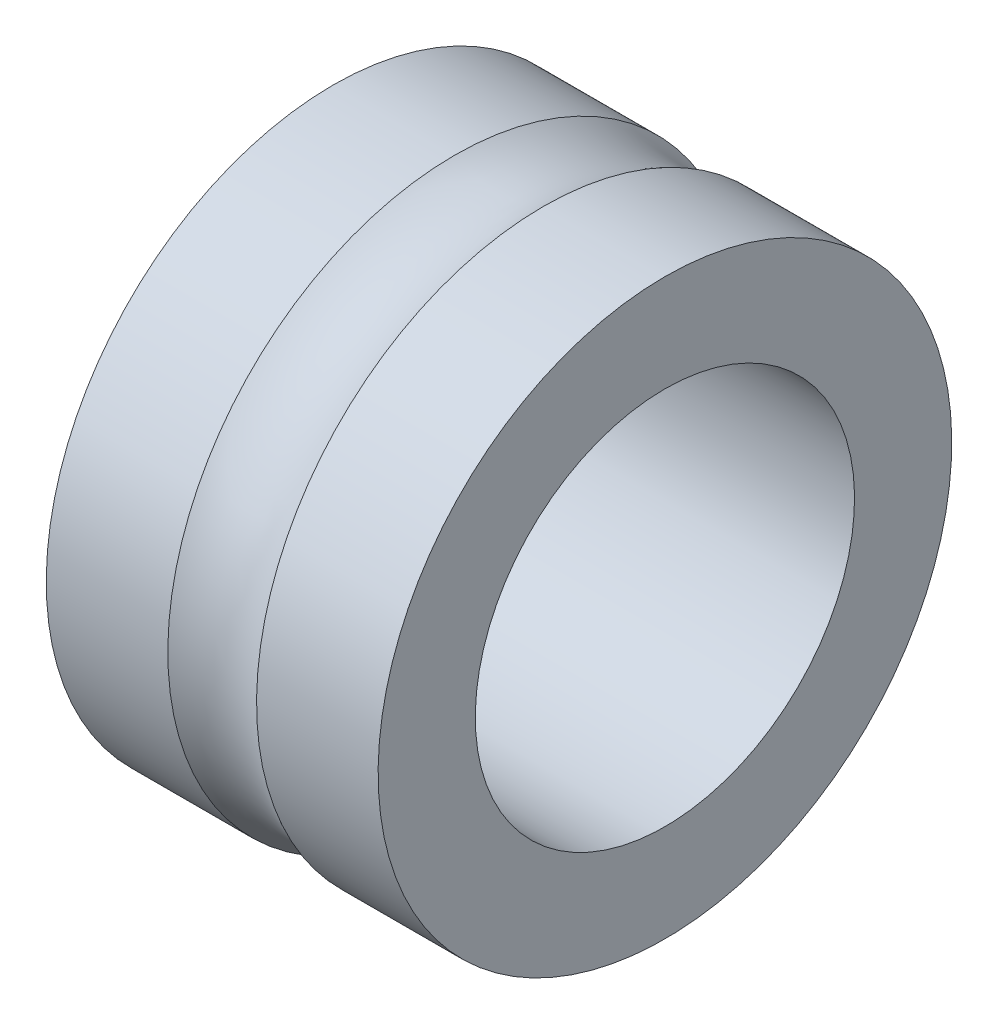
ISO-10303-21;
HEADER;
FILE_DESCRIPTION(('STEP AP214'),'2;1');
FILE_NAME('part.step','',(''),(''),'','','');
FILE_SCHEMA(('AUTOMOTIVE_DESIGN { 1 0 10303 214 1 1 1 1 }'));
ENDSEC;
DATA;
#1=APPLICATION_CONTEXT('core data for automotive mechanical design processes');
#2=APPLICATION_PROTOCOL_DEFINITION('international standard','automotive_design',2000,#1);
#3=PRODUCT_CONTEXT('',#1,'mechanical');
#4=PRODUCT('Part','Part','',(#3));
#5=PRODUCT_RELATED_PRODUCT_CATEGORY('part','',(#4));
#6=PRODUCT_DEFINITION_FORMATION('','',#4);
#7=PRODUCT_DEFINITION_CONTEXT('part definition',#1,'design');
#8=PRODUCT_DEFINITION('design','',#6,#7);
#9=PRODUCT_DEFINITION_SHAPE('','',#8);
#10=(LENGTH_UNIT() NAMED_UNIT(*) SI_UNIT(.MILLI.,.METRE.));
#11=(NAMED_UNIT(*) PLANE_ANGLE_UNIT() SI_UNIT($,.RADIAN.));
#12=(NAMED_UNIT(*) SI_UNIT($,.STERADIAN.) SOLID_ANGLE_UNIT());
#13=UNCERTAINTY_MEASURE_WITH_UNIT(LENGTH_MEASURE(1.E-05),#10,'distance_accuracy_value','');
#14=(GEOMETRIC_REPRESENTATION_CONTEXT(3) GLOBAL_UNCERTAINTY_ASSIGNED_CONTEXT((#13)) GLOBAL_UNIT_ASSIGNED_CONTEXT((#10,
#11,#12)) REPRESENTATION_CONTEXT('',''));
#15=CARTESIAN_POINT('',(0.,0.,0.));
#16=DIRECTION('',(0.,0.,1.));
#17=DIRECTION('',(1.,0.,0.));
#18=AXIS2_PLACEMENT_3D('',#15,#16,#17);
#19=CARTESIAN_POINT('',(0.,0.,0.));
#20=DIRECTION('',(1.,0.,0.));
#21=DIRECTION('',(0.,1.,0.));
#22=AXIS2_PLACEMENT_3D('',#19,#20,#21);
#23=TOROIDAL_SURFACE('',#22,7.8,1.9845);
#24=CARTESIAN_POINT('',(0.93580994331114,0.,0.));
#25=DIRECTION('',(1.,0.,0.));
#26=DIRECTION('',(0.,1.,0.));
#27=AXIS2_PLACEMENT_3D('',#24,#25,#26);
#28=CIRCLE('',#27,6.05);
#29=CARTESIAN_POINT('',(0.93580994331114,6.05,0.));
#30=VERTEX_POINT('',#29);
#31=EDGE_CURVE('E57',#30,#30,#28,.T.);
#32=ORIENTED_EDGE('',*,*,#31,.F.);
#33=EDGE_LOOP('',(#32));
#34=FACE_BOUND('',#33,.T.);
#35=CARTESIAN_POINT('',(-0.93580994331114,0.,0.));
#36=DIRECTION('',(1.,0.,0.));
#37=DIRECTION('',(0.,1.,0.));
#38=AXIS2_PLACEMENT_3D('',#35,#36,#37);
#39=CIRCLE('',#38,6.05);
#40=CARTESIAN_POINT('',(-0.935809943311141,6.05,0.));
#41=VERTEX_POINT('',#40);
#42=EDGE_CURVE('E10',#41,#41,#39,.T.);
#43=ORIENTED_EDGE('',*,*,#42,.T.);
#44=EDGE_LOOP('',(#43));
#45=FACE_BOUND('',#44,.T.);
#46=ADVANCED_FACE('F35',(#34,#45),#23,.F.);
#47=CARTESIAN_POINT('',(23.6601859567376,0.,0.));
#48=DIRECTION('',(1.,0.,0.));
#49=DIRECTION('',(0.,1.,0.));
#50=AXIS2_PLACEMENT_3D('',#47,#48,#49);
#51=CYLINDRICAL_SURFACE('',#50,6.05);
#52=ORIENTED_EDGE('',*,*,#42,.F.);
#53=EDGE_LOOP('',(#52));
#54=FACE_BOUND('',#53,.T.);
#55=CARTESIAN_POINT('',(-3.5,0.,0.));
#56=DIRECTION('',(1.,0.,0.));
#57=DIRECTION('',(0.,1.,0.));
#58=AXIS2_PLACEMENT_3D('',#55,#56,#57);
#59=CIRCLE('',#58,6.05);
#60=CARTESIAN_POINT('',(-3.5,6.05,0.));
#61=VERTEX_POINT('',#60);
#62=EDGE_CURVE('E41',#61,#61,#59,.T.);
#63=ORIENTED_EDGE('',*,*,#62,.T.);
#64=EDGE_LOOP('',(#63));
#65=FACE_BOUND('',#64,.T.);
#66=ADVANCED_FACE('F64',(#54,#65),#51,.T.);
#67=CARTESIAN_POINT('',(-3.5,0.,0.));
#68=DIRECTION('',(1.,0.,0.));
#69=DIRECTION('',(0.,1.,0.));
#70=AXIS2_PLACEMENT_3D('',#67,#68,#69);
#71=PLANE('',#70);
#72=ORIENTED_EDGE('',*,*,#62,.F.);
#73=EDGE_LOOP('',(#72));
#74=FACE_BOUND('',#73,.T.);
#75=CARTESIAN_POINT('',(-3.5,0.,0.));
#76=DIRECTION('',(1.,0.,0.));
#77=DIRECTION('',(0.,1.,0.));
#78=AXIS2_PLACEMENT_3D('',#75,#76,#77);
#79=CIRCLE('',#78,4.);
#80=CARTESIAN_POINT('',(-3.5,4.,0.));
#81=VERTEX_POINT('',#80);
#82=EDGE_CURVE('E45',#81,#81,#79,.T.);
#83=ORIENTED_EDGE('',*,*,#82,.T.);
#84=EDGE_LOOP('',(#83));
#85=FACE_BOUND('',#84,.T.);
#86=ADVANCED_FACE('F68',(#74,#85),#71,.F.);
#87=CARTESIAN_POINT('',(23.6601859567376,0.,0.));
#88=DIRECTION('',(1.,0.,0.));
#89=DIRECTION('',(0.,1.,0.));
#90=AXIS2_PLACEMENT_3D('',#87,#88,#89);
#91=CYLINDRICAL_SURFACE('',#90,4.);
#92=ORIENTED_EDGE('',*,*,#82,.F.);
#93=EDGE_LOOP('',(#92));
#94=FACE_BOUND('',#93,.T.);
#95=CARTESIAN_POINT('',(3.5,0.,0.));
#96=DIRECTION('',(1.,0.,0.));
#97=DIRECTION('',(0.,1.,0.));
#98=AXIS2_PLACEMENT_3D('',#95,#96,#97);
#99=CIRCLE('',#98,4.);
#100=CARTESIAN_POINT('',(3.5,4.,0.));
#101=VERTEX_POINT('',#100);
#102=EDGE_CURVE('E49',#101,#101,#99,.T.);
#103=ORIENTED_EDGE('',*,*,#102,.T.);
#104=EDGE_LOOP('',(#103));
#105=FACE_BOUND('',#104,.T.);
#106=ADVANCED_FACE('F74',(#94,#105),#91,.F.);
#107=CARTESIAN_POINT('',(3.5,0.,0.));
#108=DIRECTION('',(-1.,0.,0.));
#109=DIRECTION('',(0.,-1.,0.));
#110=AXIS2_PLACEMENT_3D('',#107,#108,#109);
#111=PLANE('',#110);
#112=ORIENTED_EDGE('',*,*,#102,.F.);
#113=EDGE_LOOP('',(#112));
#114=FACE_BOUND('',#113,.T.);
#115=CARTESIAN_POINT('',(3.5,0.,0.));
#116=DIRECTION('',(1.,0.,0.));
#117=DIRECTION('',(0.,1.,0.));
#118=AXIS2_PLACEMENT_3D('',#115,#116,#117);
#119=CIRCLE('',#118,6.05);
#120=CARTESIAN_POINT('',(3.5,6.05,0.));
#121=VERTEX_POINT('',#120);
#122=EDGE_CURVE('E54',#121,#121,#119,.T.);
#123=ORIENTED_EDGE('',*,*,#122,.T.);
#124=EDGE_LOOP('',(#123));
#125=FACE_BOUND('',#124,.T.);
#126=ADVANCED_FACE('F78',(#114,#125),#111,.F.);
#127=ORIENTED_EDGE('',*,*,#122,.F.);
#128=EDGE_LOOP('',(#127));
#129=FACE_BOUND('',#128,.T.);
#130=ORIENTED_EDGE('',*,*,#31,.T.);
#131=EDGE_LOOP('',(#130));
#132=FACE_BOUND('',#131,.T.);
#133=ADVANCED_FACE('F61',(#129,#132),#51,.T.);
#134=CLOSED_SHELL('',(#46,#66,#86,#106,#126,#133));
#135=MANIFOLD_SOLID_BREP('B2',#134);
#136=ADVANCED_BREP_SHAPE_REPRESENTATION('',(#18,#135),#14);
#137=SHAPE_DEFINITION_REPRESENTATION(#9,#136);
ENDSEC;
END-ISO-10303-21;
